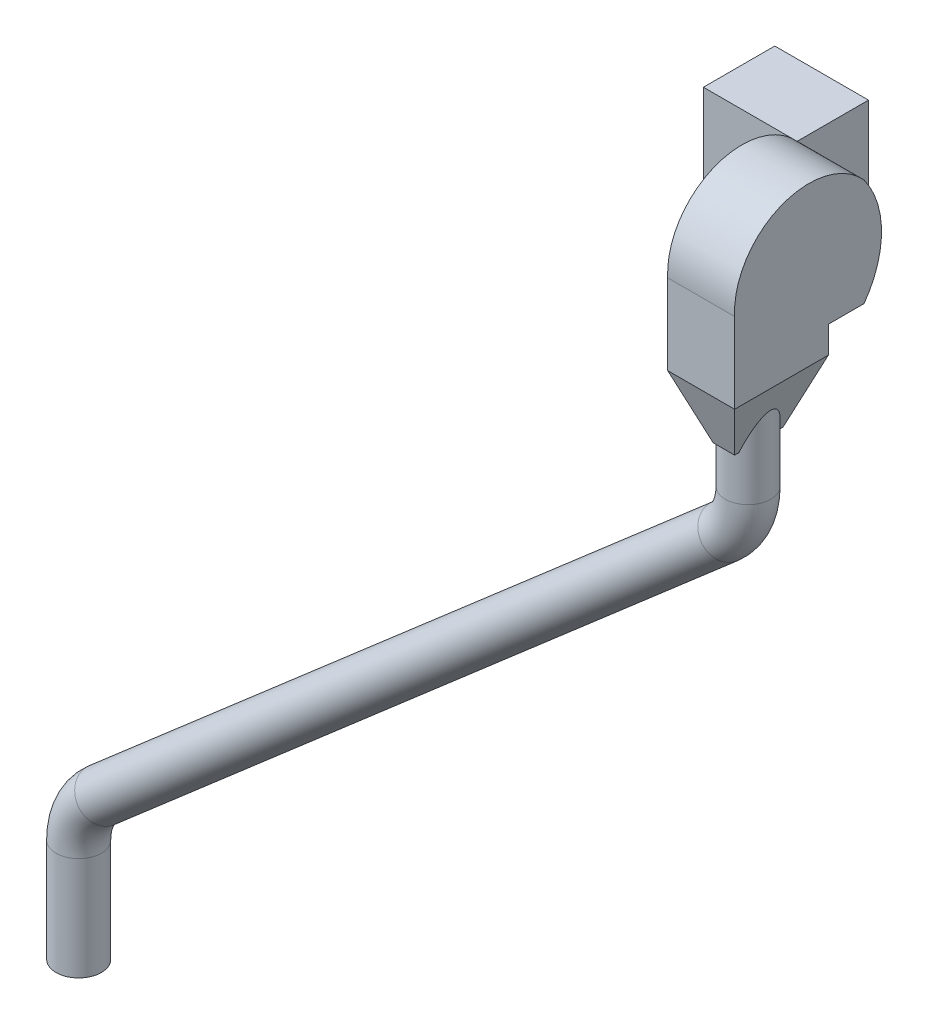
ISO-10303-21;
HEADER;
FILE_DESCRIPTION(('STEP AP214'),'2;1');
FILE_NAME('part.step','',(''),(''),'','','');
FILE_SCHEMA(('AUTOMOTIVE_DESIGN { 1 0 10303 214 1 1 1 1 }'));
ENDSEC;
DATA;
#1=APPLICATION_CONTEXT('core data for automotive mechanical design processes');
#2=APPLICATION_PROTOCOL_DEFINITION('international standard','automotive_design',2000,#1);
#3=PRODUCT_CONTEXT('',#1,'mechanical');
#4=PRODUCT('Part','Part','',(#3));
#5=PRODUCT_RELATED_PRODUCT_CATEGORY('part','',(#4));
#6=PRODUCT_DEFINITION_FORMATION('','',#4);
#7=PRODUCT_DEFINITION_CONTEXT('part definition',#1,'design');
#8=PRODUCT_DEFINITION('design','',#6,#7);
#9=PRODUCT_DEFINITION_SHAPE('','',#8);
#10=(LENGTH_UNIT() NAMED_UNIT(*) SI_UNIT(.MILLI.,.METRE.));
#11=(NAMED_UNIT(*) PLANE_ANGLE_UNIT() SI_UNIT($,.RADIAN.));
#12=(NAMED_UNIT(*) SI_UNIT($,.STERADIAN.) SOLID_ANGLE_UNIT());
#13=UNCERTAINTY_MEASURE_WITH_UNIT(LENGTH_MEASURE(1.E-05),#10,'distance_accuracy_value','');
#14=(GEOMETRIC_REPRESENTATION_CONTEXT(3) GLOBAL_UNCERTAINTY_ASSIGNED_CONTEXT((#13)) GLOBAL_UNIT_ASSIGNED_CONTEXT((#10,
#11,#12)) REPRESENTATION_CONTEXT('',''));
#15=CARTESIAN_POINT('',(0.,0.,0.));
#16=DIRECTION('',(0.,0.,1.));
#17=DIRECTION('',(1.,0.,0.));
#18=AXIS2_PLACEMENT_3D('',#15,#16,#17);
#19=CARTESIAN_POINT('',(255.,-120.,160.));
#20=DIRECTION('',(0.,1.,0.));
#21=DIRECTION('',(0.,0.,1.));
#22=AXIS2_PLACEMENT_3D('',#19,#20,#21);
#23=PLANE('',#22);
#24=DIRECTION('',(1.,0.,0.));
#25=VECTOR('',#24,1.);
#26=CARTESIAN_POINT('',(255.,-120.,239.857858587835));
#27=LINE('',#26,#25);
#28=CARTESIAN_POINT('',(105.,-120.,239.857858587835));
#29=VERTEX_POINT('',#28);
#30=CARTESIAN_POINT('',(255.,-120.,239.857858587835));
#31=VERTEX_POINT('',#30);
#32=EDGE_CURVE('E133',#29,#31,#27,.T.);
#33=ORIENTED_EDGE('',*,*,#32,.F.);
#34=DIRECTION('',(0.,0.,-1.));
#35=VECTOR('',#34,1.);
#36=CARTESIAN_POINT('',(105.,-120.,160.));
#37=LINE('',#36,#35);
#38=CARTESIAN_POINT('',(105.,-120.,160.));
#39=VERTEX_POINT('',#38);
#40=EDGE_CURVE('E145',#29,#39,#37,.T.);
#41=ORIENTED_EDGE('',*,*,#40,.T.);
#42=DIRECTION('',(-1.,0.,0.));
#43=VECTOR('',#42,1.);
#44=CARTESIAN_POINT('',(255.,-120.,160.));
#45=LINE('',#44,#43);
#46=CARTESIAN_POINT('',(255.,-120.,160.));
#47=VERTEX_POINT('',#46);
#48=EDGE_CURVE('E201',#47,#39,#45,.T.);
#49=ORIENTED_EDGE('',*,*,#48,.F.);
#50=DIRECTION('',(0.,0.,-1.));
#51=VECTOR('',#50,1.);
#52=CARTESIAN_POINT('',(255.,-120.,160.));
#53=LINE('',#52,#51);
#54=EDGE_CURVE('E199',#31,#47,#53,.T.);
#55=ORIENTED_EDGE('',*,*,#54,.F.);
#56=EDGE_LOOP('',(#33,#41,#49,#55));
#57=FACE_BOUND('',#56,.T.);
#58=ADVANCED_FACE('F45',(#57),#23,.F.);
#59=CARTESIAN_POINT('',(255.,0.,324.123215286529));
#60=DIRECTION('',(-1.,0.,0.));
#61=DIRECTION('',(0.,0.,1.));
#62=AXIS2_PLACEMENT_3D('',#59,#60,#61);
#63=CYLINDRICAL_SURFACE('',#62,203.31362422619);
#64=CARTESIAN_POINT('',(105.,0.,324.123215286529));
#65=DIRECTION('',(1.,0.,0.));
#66=DIRECTION('',(0.,0.,-1.));
#67=AXIS2_PLACEMENT_3D('',#64,#65,#66);
#68=CIRCLE('',#67,203.31362422619);
#69=CARTESIAN_POINT('',(105.,120.,160.));
#70=VERTEX_POINT('',#69);
#71=EDGE_CURVE('E191',#39,#70,#68,.T.);
#72=ORIENTED_EDGE('',*,*,#71,.T.);
#73=DIRECTION('',(-1.,0.,0.));
#74=VECTOR('',#73,1.);
#75=CARTESIAN_POINT('',(255.,120.,160.));
#76=LINE('',#75,#74);
#77=CARTESIAN_POINT('',(255.,120.,160.));
#78=VERTEX_POINT('',#77);
#79=EDGE_CURVE('E209',#78,#70,#76,.T.);
#80=ORIENTED_EDGE('',*,*,#79,.F.);
#81=CARTESIAN_POINT('',(255.,0.,324.123215286529));
#82=DIRECTION('',(1.,0.,0.));
#83=DIRECTION('',(0.,0.,-1.));
#84=AXIS2_PLACEMENT_3D('',#81,#82,#83);
#85=CIRCLE('',#84,203.31362422619);
#86=EDGE_CURVE('E192',#47,#78,#85,.T.);
#87=ORIENTED_EDGE('',*,*,#86,.F.);
#88=ORIENTED_EDGE('',*,*,#48,.T.);
#89=EDGE_LOOP('',(#72,#80,#87,#88));
#90=FACE_BOUND('',#89,.T.);
#91=ADVANCED_FACE('F47',(#90),#63,.T.);
#92=CARTESIAN_POINT('',(255.,8.53871556863522,283.705675407711));
#93=DIRECTION('',(-1.,0.,0.));
#94=DIRECTION('',(0.,0.,1.));
#95=AXIS2_PLACEMENT_3D('',#92,#93,#94);
#96=CYLINDRICAL_SURFACE('',#95,166.513399025927);
#97=CARTESIAN_POINT('',(105.,8.53871556863522,283.705675407711));
#98=DIRECTION('',(1.,0.,0.));
#99=DIRECTION('',(0.,0.,1.));
#100=AXIS2_PLACEMENT_3D('',#97,#98,#99);
#101=CIRCLE('',#100,166.513399025927);
#102=CARTESIAN_POINT('',(105.,0.,450.));
#103=VERTEX_POINT('',#102);
#104=EDGE_CURVE('E146',#70,#103,#101,.T.);
#105=ORIENTED_EDGE('',*,*,#104,.T.);
#106=DIRECTION('',(-1.,0.,0.));
#107=VECTOR('',#106,1.);
#108=CARTESIAN_POINT('',(255.,0.,450.));
#109=LINE('',#108,#107);
#110=CARTESIAN_POINT('',(255.,0.,450.));
#111=VERTEX_POINT('',#110);
#112=EDGE_CURVE('E144',#111,#103,#109,.T.);
#113=ORIENTED_EDGE('',*,*,#112,.F.);
#114=CARTESIAN_POINT('',(255.,8.53871556863522,283.705675407711));
#115=DIRECTION('',(1.,0.,0.));
#116=DIRECTION('',(0.,0.,1.));
#117=AXIS2_PLACEMENT_3D('',#114,#115,#116);
#118=CIRCLE('',#117,166.513399025927);
#119=EDGE_CURVE('E195',#78,#111,#118,.T.);
#120=ORIENTED_EDGE('',*,*,#119,.F.);
#121=ORIENTED_EDGE('',*,*,#79,.T.);
#122=EDGE_LOOP('',(#105,#113,#120,#121));
#123=FACE_BOUND('',#122,.T.);
#124=ADVANCED_FACE('F234',(#123),#96,.T.);
#125=CARTESIAN_POINT('',(255.,-120.,450.));
#126=DIRECTION('',(0.,0.,-1.));
#127=DIRECTION('',(-1.,0.,0.));
#128=AXIS2_PLACEMENT_3D('',#125,#126,#127);
#129=PLANE('',#128);
#130=DIRECTION('',(0.,-1.,0.));
#131=VECTOR('',#130,1.);
#132=CARTESIAN_POINT('',(105.,-120.,450.));
#133=LINE('',#132,#131);
#134=CARTESIAN_POINT('',(105.,-180.,450.));
#135=VERTEX_POINT('',#134);
#136=EDGE_CURVE('E124',#103,#135,#133,.T.);
#137=ORIENTED_EDGE('',*,*,#136,.T.);
#138=DIRECTION('',(-1.,0.,0.));
#139=VECTOR('',#138,1.);
#140=CARTESIAN_POINT('',(105.,-180.,450.));
#141=LINE('',#140,#139);
#142=CARTESIAN_POINT('',(255.,-180.,450.));
#143=VERTEX_POINT('',#142);
#144=EDGE_CURVE('E141',#143,#135,#141,.T.);
#145=ORIENTED_EDGE('',*,*,#144,.F.);
#146=DIRECTION('',(0.,-1.,0.));
#147=VECTOR('',#146,1.);
#148=CARTESIAN_POINT('',(255.,-120.,450.));
#149=LINE('',#148,#147);
#150=EDGE_CURVE('E197',#111,#143,#149,.T.);
#151=ORIENTED_EDGE('',*,*,#150,.F.);
#152=ORIENTED_EDGE('',*,*,#112,.T.);
#153=EDGE_LOOP('',(#137,#145,#151,#152));
#154=FACE_BOUND('',#153,.T.);
#155=ADVANCED_FACE('F139',(#154),#129,.F.);
#156=CARTESIAN_POINT('',(255.,0.,324.123215286529));
#157=DIRECTION('',(1.,0.,0.));
#158=DIRECTION('',(0.,0.,-1.));
#159=AXIS2_PLACEMENT_3D('',#156,#157,#158);
#160=PLANE('',#159);
#161=ORIENTED_EDGE('',*,*,#86,.T.);
#162=ORIENTED_EDGE('',*,*,#119,.T.);
#163=ORIENTED_EDGE('',*,*,#150,.T.);
#164=DIRECTION('',(0.,0.,1.));
#165=VECTOR('',#164,1.);
#166=CARTESIAN_POINT('',(255.,-180.,450.));
#167=LINE('',#166,#165);
#168=CARTESIAN_POINT('',(255.,-180.,239.857858587835));
#169=VERTEX_POINT('',#168);
#170=EDGE_CURVE('E158',#169,#143,#167,.T.);
#171=ORIENTED_EDGE('',*,*,#170,.F.);
#172=DIRECTION('',(0.,1.,0.));
#173=VECTOR('',#172,1.);
#174=CARTESIAN_POINT('',(255.,-180.,239.857858587835));
#175=LINE('',#174,#173);
#176=EDGE_CURVE('E157',#169,#31,#175,.T.);
#177=ORIENTED_EDGE('',*,*,#176,.T.);
#178=ORIENTED_EDGE('',*,*,#54,.T.);
#179=EDGE_LOOP('',(#161,#162,#163,#171,#177,#178));
#180=FACE_BOUND('',#179,.T.);
#181=ADVANCED_FACE('F222',(#180),#160,.T.);
#182=CARTESIAN_POINT('',(105.,0.,324.123215286529));
#183=DIRECTION('',(1.,0.,0.));
#184=DIRECTION('',(0.,0.,-1.));
#185=AXIS2_PLACEMENT_3D('',#182,#183,#184);
#186=PLANE('',#185);
#187=ORIENTED_EDGE('',*,*,#71,.F.);
#188=ORIENTED_EDGE('',*,*,#40,.F.);
#189=DIRECTION('',(0.,1.,0.));
#190=VECTOR('',#189,1.);
#191=CARTESIAN_POINT('',(105.,-180.,239.857858587835));
#192=LINE('',#191,#190);
#193=CARTESIAN_POINT('',(105.,-180.,239.857858587835));
#194=VERTEX_POINT('',#193);
#195=EDGE_CURVE('E127',#194,#29,#192,.T.);
#196=ORIENTED_EDGE('',*,*,#195,.F.);
#197=DIRECTION('',(0.,0.,-1.));
#198=VECTOR('',#197,1.);
#199=CARTESIAN_POINT('',(105.,-180.,239.857858587835));
#200=LINE('',#199,#198);
#201=EDGE_CURVE('E120',#135,#194,#200,.T.);
#202=ORIENTED_EDGE('',*,*,#201,.F.);
#203=ORIENTED_EDGE('',*,*,#136,.F.);
#204=ORIENTED_EDGE('',*,*,#104,.F.);
#205=EDGE_LOOP('',(#187,#188,#196,#202,#203,#204));
#206=FACE_BOUND('',#205,.T.);
#207=ADVANCED_FACE('F123',(#206),#186,.F.);
#208=CARTESIAN_POINT('',(255.,-180.,239.857858587835));
#209=DIRECTION('',(0.,0.,1.));
#210=DIRECTION('',(0.,-1.,0.));
#211=AXIS2_PLACEMENT_3D('',#208,#209,#210);
#212=PLANE('',#211);
#213=ORIENTED_EDGE('',*,*,#32,.T.);
#214=ORIENTED_EDGE('',*,*,#176,.F.);
#215=DIRECTION('',(1.,0.,0.));
#216=VECTOR('',#215,1.);
#217=CARTESIAN_POINT('',(255.,-180.,239.857858587835));
#218=LINE('',#217,#216);
#219=EDGE_CURVE('E132',#194,#169,#218,.T.);
#220=ORIENTED_EDGE('',*,*,#219,.F.);
#221=ORIENTED_EDGE('',*,*,#195,.T.);
#222=EDGE_LOOP('',(#213,#214,#220,#221));
#223=FACE_BOUND('',#222,.T.);
#224=ADVANCED_FACE('F227',(#223),#212,.F.);
#225=CARTESIAN_POINT('',(0.,-320.,0.));
#226=DIRECTION('',(0.,1.,0.));
#227=DIRECTION('',(0.,0.,1.));
#228=AXIS2_PLACEMENT_3D('',#225,#226,#227);
#229=PLANE('',#228);
#230=DIRECTION('',(0.,0.,-1.));
#231=VECTOR('',#230,1.);
#232=CARTESIAN_POINT('',(204.044167202732,-320.,0.));
#233=LINE('',#232,#231);
#234=CARTESIAN_POINT('',(204.044167202732,-320.,290.813691385104));
#235=VERTEX_POINT('',#234);
#236=CARTESIAN_POINT('',(204.044167202732,-320.,300.179426240508));
#237=VERTEX_POINT('',#236);
#238=EDGE_CURVE('E168',#235,#237,#233,.F.);
#239=ORIENTED_EDGE('',*,*,#238,.T.);
#240=CARTESIAN_POINT('',(180.,-320.,344.928929293918));
#241=DIRECTION('',(0.,1.,0.));
#242=DIRECTION('',(0.,0.,1.));
#243=AXIS2_PLACEMENT_3D('',#240,#241,#242);
#244=CIRCLE('',#243,50.8);
#245=CARTESIAN_POINT('',(155.955832797268,-320.,300.179426240508));
#246=VERTEX_POINT('',#245);
#247=EDGE_CURVE('E12',#237,#246,#244,.T.);
#248=ORIENTED_EDGE('',*,*,#247,.T.);
#249=DIRECTION('',(0.,0.,1.));
#250=VECTOR('',#249,1.);
#251=CARTESIAN_POINT('',(155.955832797268,-320.,0.));
#252=LINE('',#251,#250);
#253=CARTESIAN_POINT('',(155.955832797268,-320.,290.813691385104));
#254=VERTEX_POINT('',#253);
#255=EDGE_CURVE('E178',#246,#254,#252,.F.);
#256=ORIENTED_EDGE('',*,*,#255,.T.);
#257=DIRECTION('',(-1.,0.,0.));
#258=VECTOR('',#257,1.);
#259=CARTESIAN_POINT('',(0.,-320.,290.813691385104));
#260=LINE('',#259,#258);
#261=EDGE_CURVE('E177',#254,#235,#260,.F.);
#262=ORIENTED_EDGE('',*,*,#261,.T.);
#263=EDGE_LOOP('',(#239,#248,#256,#262));
#264=FACE_BOUND('',#263,.T.);
#265=ADVANCED_FACE('F252',(#264),#229,.F.);
#266=CARTESIAN_POINT('',(105.,-180.,239.857858587835));
#267=DIRECTION('',(-0.939692620785908,-0.342020143325669,0.));
#268=DIRECTION('',(0.342020143325669,-0.939692620785908,0.));
#269=AXIS2_PLACEMENT_3D('',#266,#267,#268);
#270=PLANE('',#269);
#271=ORIENTED_EDGE('',*,*,#255,.F.);
#272=CARTESIAN_POINT('',(180.,-386.060806459097,344.928929293918));
#273=DIRECTION('',(-0.939692620785908,-0.342020143325669,0.));
#274=DIRECTION('',(-0.342020143325669,0.939692620785908,0.));
#275=AXIS2_PLACEMENT_3D('',#272,#273,#274);
#276=ELLIPSE('',#275,148.529263528285,50.8);
#277=CARTESIAN_POINT('',(155.955832797268,-320.,389.678432347327));
#278=VERTEX_POINT('',#277);
#279=EDGE_CURVE('E49',#246,#278,#276,.F.);
#280=ORIENTED_EDGE('',*,*,#279,.T.);
#281=CARTESIAN_POINT('',(155.955832797268,-320.,399.044167202732));
#282=VERTEX_POINT('',#281);
#283=EDGE_CURVE('E163',#282,#278,#252,.F.);
#284=ORIENTED_EDGE('',*,*,#283,.F.);
#285=DIRECTION('',(-0.323615577118185,0.889126490715988,0.323615577118185));
#286=VECTOR('',#285,1.);
#287=CARTESIAN_POINT('',(127.007564817849,-240.465287394225,427.992435182151));
#288=LINE('',#287,#286);
#289=EDGE_CURVE('E153',#282,#135,#288,.T.);
#290=ORIENTED_EDGE('',*,*,#289,.T.);
#291=ORIENTED_EDGE('',*,*,#201,.T.);
#292=DIRECTION('',(-0.323615577118185,0.889126490715988,-0.323615577118185));
#293=VECTOR('',#292,1.);
#294=CARTESIAN_POINT('',(120.70905626303,-223.160277363618,255.566914850866));
#295=LINE('',#294,#293);
#296=EDGE_CURVE('E171',#254,#194,#295,.T.);
#297=ORIENTED_EDGE('',*,*,#296,.F.);
#298=EDGE_LOOP('',(#271,#280,#284,#290,#291,#297));
#299=FACE_BOUND('',#298,.T.);
#300=ADVANCED_FACE('F161',(#299),#270,.T.);
#301=CARTESIAN_POINT('',(255.,-180.,239.857858587835));
#302=DIRECTION('',(0.,-0.342020143325669,-0.939692620785908));
#303=DIRECTION('',(0.,0.939692620785908,-0.342020143325669));
#304=AXIS2_PLACEMENT_3D('',#301,#302,#303);
#305=PLANE('',#304);
#306=ORIENTED_EDGE('',*,*,#219,.T.);
#307=DIRECTION('',(0.323615577118185,0.889126490715988,-0.323615577118185));
#308=VECTOR('',#307,1.);
#309=CARTESIAN_POINT('',(232.992435182151,-240.465287394225,261.865423405684));
#310=LINE('',#309,#308);
#311=EDGE_CURVE('E166',#235,#169,#310,.T.);
#312=ORIENTED_EDGE('',*,*,#311,.F.);
#313=ORIENTED_EDGE('',*,*,#261,.F.);
#314=ORIENTED_EDGE('',*,*,#296,.T.);
#315=EDGE_LOOP('',(#306,#312,#313,#314));
#316=FACE_BOUND('',#315,.T.);
#317=ADVANCED_FACE('F224',(#316),#305,.T.);
#318=CARTESIAN_POINT('',(255.,-180.,450.));
#319=DIRECTION('',(0.939692620785908,-0.342020143325669,0.));
#320=DIRECTION('',(0.342020143325669,0.939692620785908,0.));
#321=AXIS2_PLACEMENT_3D('',#318,#319,#320);
#322=PLANE('',#321);
#323=CARTESIAN_POINT('',(204.044167202732,-320.,389.678432347327));
#324=VERTEX_POINT('',#323);
#325=CARTESIAN_POINT('',(204.044167202732,-320.,399.044167202732));
#326=VERTEX_POINT('',#325);
#327=EDGE_CURVE('E180',#324,#326,#233,.F.);
#328=ORIENTED_EDGE('',*,*,#327,.F.);
#329=CARTESIAN_POINT('',(180.,-386.060806459097,344.928929293918));
#330=DIRECTION('',(0.939692620785908,-0.342020143325669,0.));
#331=DIRECTION('',(0.342020143325669,0.939692620785908,0.));
#332=AXIS2_PLACEMENT_3D('',#329,#330,#331);
#333=ELLIPSE('',#332,148.529263528285,50.8);
#334=EDGE_CURVE('E212',#324,#237,#333,.F.);
#335=ORIENTED_EDGE('',*,*,#334,.T.);
#336=ORIENTED_EDGE('',*,*,#238,.F.);
#337=ORIENTED_EDGE('',*,*,#311,.T.);
#338=ORIENTED_EDGE('',*,*,#170,.T.);
#339=DIRECTION('',(0.323615577118185,0.889126490715988,0.323615577118185));
#340=VECTOR('',#339,1.);
#341=CARTESIAN_POINT('',(239.29094373697,-223.160277363618,434.29094373697));
#342=LINE('',#341,#340);
#343=EDGE_CURVE('E156',#326,#143,#342,.T.);
#344=ORIENTED_EDGE('',*,*,#343,.F.);
#345=EDGE_LOOP('',(#328,#335,#336,#337,#338,#344));
#346=FACE_BOUND('',#345,.T.);
#347=ADVANCED_FACE('F218',(#346),#322,.T.);
#348=CARTESIAN_POINT('',(105.,-180.,450.));
#349=DIRECTION('',(0.,-0.342020143325669,0.939692620785908));
#350=DIRECTION('',(0.,-0.939692620785908,-0.342020143325669));
#351=AXIS2_PLACEMENT_3D('',#348,#349,#350);
#352=PLANE('',#351);
#353=ORIENTED_EDGE('',*,*,#144,.T.);
#354=ORIENTED_EDGE('',*,*,#289,.F.);
#355=DIRECTION('',(1.,0.,0.));
#356=VECTOR('',#355,1.);
#357=CARTESIAN_POINT('',(0.,-320.,399.044167202732));
#358=LINE('',#357,#356);
#359=EDGE_CURVE('E164',#326,#282,#358,.F.);
#360=ORIENTED_EDGE('',*,*,#359,.F.);
#361=ORIENTED_EDGE('',*,*,#343,.T.);
#362=EDGE_LOOP('',(#353,#354,#360,#361));
#363=FACE_BOUND('',#362,.T.);
#364=ADVANCED_FACE('F151',(#363),#352,.T.);
#365=ORIENTED_EDGE('',*,*,#283,.T.);
#366=EDGE_CURVE('E55',#278,#324,#244,.T.);
#367=ORIENTED_EDGE('',*,*,#366,.T.);
#368=ORIENTED_EDGE('',*,*,#327,.T.);
#369=ORIENTED_EDGE('',*,*,#359,.T.);
#370=EDGE_LOOP('',(#365,#367,#368,#369));
#371=FACE_BOUND('',#370,.T.);
#372=ADVANCED_FACE('F217',(#371),#229,.F.);
#373=CARTESIAN_POINT('',(180.,-350.,344.928929293918));
#374=DIRECTION('',(0.,1.,0.));
#375=DIRECTION('',(0.,0.,1.));
#376=AXIS2_PLACEMENT_3D('',#373,#374,#375);
#377=CYLINDRICAL_SURFACE('',#376,50.8);
#378=ORIENTED_EDGE('',*,*,#247,.F.);
#379=ORIENTED_EDGE('',*,*,#334,.F.);
#380=ORIENTED_EDGE('',*,*,#366,.F.);
#381=ORIENTED_EDGE('',*,*,#279,.F.);
#382=EDGE_LOOP('',(#378,#379,#380,#381));
#383=FACE_BOUND('',#382,.T.);
#384=CARTESIAN_POINT('',(180.,-419.373633231244,344.928929293918));
#385=DIRECTION('',(0.,-1.,0.));
#386=DIRECTION('',(0.,0.,-1.));
#387=AXIS2_PLACEMENT_3D('',#384,#385,#386);
#388=CIRCLE('',#387,50.8);
#389=CARTESIAN_POINT('',(230.8,-419.373633231244,344.928929293918));
#390=VERTEX_POINT('',#389);
#391=EDGE_CURVE('E291',#390,#390,#388,.T.);
#392=ORIENTED_EDGE('',*,*,#391,.F.);
#393=EDGE_LOOP('',(#392));
#394=FACE_BOUND('',#393,.T.);
#395=ADVANCED_FACE('F253',(#383,#394),#377,.T.);
#396=CARTESIAN_POINT('',(30.,-419.373633231244,344.928929293918));
#397=DIRECTION('',(0.,0.,-1.));
#398=DIRECTION('',(-1.,0.,0.));
#399=AXIS2_PLACEMENT_3D('',#396,#397,#398);
#400=TOROIDAL_SURFACE('',#399,150.,50.8);
#401=CARTESIAN_POINT('',(128.239580762676,-532.726995649717,344.928929293918));
#402=DIRECTION('',(-0.755689082789818,-0.654930538417841,0.));
#403=DIRECTION('',(0.,0.,-1.));
#404=AXIS2_PLACEMENT_3D('',#401,#402,#403);
#405=CIRCLE('',#404,50.8);
#406=CARTESIAN_POINT('',(161.510052114303,-571.11600105544,344.928929293918));
#407=VERTEX_POINT('',#406);
#408=EDGE_CURVE('E294',#407,#407,#405,.T.);
#409=CARTESIAN_POINT('',(30.,-419.373633231244,344.928929293918));
#410=DIRECTION('',(0.,0.,-1.));
#411=DIRECTION('',(-1.,0.,0.));
#412=AXIS2_PLACEMENT_3D('',#409,#410,#411);
#413=CIRCLE('',#412,200.8);
#414=EDGE_CURVE('',#390,#407,#413,.T.);
#415=ORIENTED_EDGE('',*,*,#391,.T.);
#416=ORIENTED_EDGE('',*,*,#408,.F.);
#417=ORIENTED_EDGE('',*,*,#414,.T.);
#418=ORIENTED_EDGE('',*,*,#414,.F.);
#419=EDGE_LOOP('',(#415,#417,#416,#418));
#420=FACE_BOUND('',#419,.T.);
#421=ADVANCED_FACE('F256',(#420),#400,.T.);
#422=CARTESIAN_POINT('',(128.239580762676,-532.726995649717,344.928929293918));
#423=DIRECTION('',(-0.755689082789818,-0.654930538417842,0.));
#424=DIRECTION('',(0.654930538417842,-0.755689082789818,0.));
#425=AXIS2_PLACEMENT_3D('',#422,#423,#424);
#426=CYLINDRICAL_SURFACE('',#425,50.8);
#427=CARTESIAN_POINT('',(-1268.23958076268,-1743.00893563836,344.928929293918));
#428=DIRECTION('',(-0.755689082789818,-0.654930538417841,0.));
#429=DIRECTION('',(0.,0.,-1.));
#430=AXIS2_PLACEMENT_3D('',#427,#428,#429);
#431=CIRCLE('',#430,50.8);
#432=CARTESIAN_POINT('',(-1301.5100521143,-1704.61993023263,344.928929293918));
#433=VERTEX_POINT('',#432);
#434=EDGE_CURVE('E299',#433,#433,#431,.T.);
#435=ORIENTED_EDGE('',*,*,#434,.F.);
#436=EDGE_LOOP('',(#435));
#437=FACE_BOUND('',#436,.T.);
#438=ORIENTED_EDGE('',*,*,#408,.T.);
#439=EDGE_LOOP('',(#438));
#440=FACE_BOUND('',#439,.T.);
#441=ADVANCED_FACE('F275',(#437,#440),#426,.T.);
#442=CARTESIAN_POINT('',(-1170.,-1856.36229805683,344.928929293918));
#443=DIRECTION('',(0.,0.,1.));
#444=DIRECTION('',(1.,0.,0.));
#445=AXIS2_PLACEMENT_3D('',#442,#443,#444);
#446=TOROIDAL_SURFACE('',#445,150.,50.8);
#447=CARTESIAN_POINT('',(-1320.,-1856.36229805683,344.928929293918));
#448=DIRECTION('',(0.,-1.,0.));
#449=DIRECTION('',(0.,0.,-1.));
#450=AXIS2_PLACEMENT_3D('',#447,#448,#449);
#451=CIRCLE('',#450,50.8);
#452=CARTESIAN_POINT('',(-1370.8,-1856.36229805683,344.928929293918));
#453=VERTEX_POINT('',#452);
#454=EDGE_CURVE('E301',#453,#453,#451,.T.);
#455=CARTESIAN_POINT('',(-1170.,-1856.36229805683,344.928929293918));
#456=DIRECTION('',(0.,0.,1.));
#457=DIRECTION('',(1.,0.,0.));
#458=AXIS2_PLACEMENT_3D('',#455,#456,#457);
#459=CIRCLE('',#458,200.8);
#460=EDGE_CURVE('',#433,#453,#459,.T.);
#461=ORIENTED_EDGE('',*,*,#434,.T.);
#462=ORIENTED_EDGE('',*,*,#454,.F.);
#463=ORIENTED_EDGE('',*,*,#460,.T.);
#464=ORIENTED_EDGE('',*,*,#460,.F.);
#465=EDGE_LOOP('',(#461,#463,#462,#464));
#466=FACE_BOUND('',#465,.T.);
#467=ADVANCED_FACE('F271',(#466),#446,.T.);
#468=CARTESIAN_POINT('',(-1320.,-1856.36229805683,344.928929293918));
#469=DIRECTION('',(0.,-1.,0.));
#470=DIRECTION('',(0.,0.,-1.));
#471=AXIS2_PLACEMENT_3D('',#468,#469,#470);
#472=CYLINDRICAL_SURFACE('',#471,50.8);
#473=ORIENTED_EDGE('',*,*,#454,.T.);
#474=EDGE_LOOP('',(#473));
#475=FACE_BOUND('',#474,.T.);
#476=CARTESIAN_POINT('',(-1320.,-2087.86796564404,344.928929293918));
#477=DIRECTION('',(0.,-1.,0.));
#478=DIRECTION('',(0.,0.,-1.));
#479=AXIS2_PLACEMENT_3D('',#476,#477,#478);
#480=CIRCLE('',#479,50.8);
#481=CARTESIAN_POINT('',(-1320.,-2087.86796564404,294.128929293918));
#482=VERTEX_POINT('',#481);
#483=EDGE_CURVE('E289',#482,#482,#480,.T.);
#484=ORIENTED_EDGE('',*,*,#483,.F.);
#485=EDGE_LOOP('',(#484));
#486=FACE_BOUND('',#485,.T.);
#487=ADVANCED_FACE('F257',(#475,#486),#472,.T.);
#488=CARTESIAN_POINT('',(-1320.,-2087.86796564404,344.928929293918));
#489=DIRECTION('',(0.,-1.,0.));
#490=DIRECTION('',(0.,0.,-1.));
#491=AXIS2_PLACEMENT_3D('',#488,#489,#490);
#492=PLANE('',#491);
#493=ORIENTED_EDGE('',*,*,#483,.T.);
#494=EDGE_LOOP('',(#493));
#495=FACE_BOUND('',#494,.T.);
#496=ADVANCED_FACE('F270',(#495),#492,.T.);
#497=CLOSED_SHELL('',(#58,#91,#124,#155,#181,#207,#224,#265,#300,#317,#347,#364,#372,#395,#421,
#441,#467,#487,#496));
#498=MANIFOLD_SOLID_BREP('B2',#497);
#499=CARTESIAN_POINT('',(105.,-120.,160.));
#500=DIRECTION('',(-1.,0.,0.));
#501=DIRECTION('',(0.,0.,1.));
#502=AXIS2_PLACEMENT_3D('',#499,#500,#501);
#503=PLANE('',#502);
#504=DIRECTION('',(0.,1.,0.));
#505=VECTOR('',#504,1.);
#506=CARTESIAN_POINT('',(105.,-120.,0.));
#507=LINE('',#506,#505);
#508=CARTESIAN_POINT('',(105.,-120.,0.));
#509=VERTEX_POINT('',#508);
#510=CARTESIAN_POINT('',(105.,120.,0.));
#511=VERTEX_POINT('',#510);
#512=EDGE_CURVE('E527',#509,#511,#507,.T.);
#513=ORIENTED_EDGE('',*,*,#512,.T.);
#514=DIRECTION('',(0.,0.,-1.));
#515=VECTOR('',#514,1.);
#516=CARTESIAN_POINT('',(105.,120.,160.));
#517=LINE('',#516,#515);
#518=CARTESIAN_POINT('',(105.,120.,160.));
#519=VERTEX_POINT('',#518);
#520=EDGE_CURVE('E43',#519,#511,#517,.T.);
#521=ORIENTED_EDGE('',*,*,#520,.F.);
#522=DIRECTION('',(0.,1.,0.));
#523=VECTOR('',#522,1.);
#524=CARTESIAN_POINT('',(105.,-120.,160.));
#525=LINE('',#524,#523);
#526=CARTESIAN_POINT('',(105.,-120.,160.));
#527=VERTEX_POINT('',#526);
#528=EDGE_CURVE('E515',#527,#519,#525,.T.);
#529=ORIENTED_EDGE('',*,*,#528,.F.);
#530=DIRECTION('',(0.,0.,-1.));
#531=VECTOR('',#530,1.);
#532=CARTESIAN_POINT('',(105.,-120.,160.));
#533=LINE('',#532,#531);
#534=EDGE_CURVE('E523',#527,#509,#533,.T.);
#535=ORIENTED_EDGE('',*,*,#534,.T.);
#536=EDGE_LOOP('',(#513,#521,#529,#535));
#537=FACE_BOUND('',#536,.T.);
#538=ADVANCED_FACE('F464',(#537),#503,.F.);
#539=CARTESIAN_POINT('',(-105.,120.,160.));
#540=DIRECTION('',(0.,-1.,0.));
#541=DIRECTION('',(0.,0.,-1.));
#542=AXIS2_PLACEMENT_3D('',#539,#540,#541);
#543=PLANE('',#542);
#544=DIRECTION('',(-1.,0.,0.));
#545=VECTOR('',#544,1.);
#546=CARTESIAN_POINT('',(-105.,120.,0.));
#547=LINE('',#546,#545);
#548=CARTESIAN_POINT('',(-105.,120.,0.));
#549=VERTEX_POINT('',#548);
#550=EDGE_CURVE('E519',#511,#549,#547,.T.);
#551=ORIENTED_EDGE('',*,*,#550,.T.);
#552=DIRECTION('',(0.,0.,-1.));
#553=VECTOR('',#552,1.);
#554=CARTESIAN_POINT('',(-105.,120.,160.));
#555=LINE('',#554,#553);
#556=CARTESIAN_POINT('',(-105.,120.,160.));
#557=VERTEX_POINT('',#556);
#558=EDGE_CURVE('E472',#557,#549,#555,.T.);
#559=ORIENTED_EDGE('',*,*,#558,.F.);
#560=DIRECTION('',(-1.,0.,0.));
#561=VECTOR('',#560,1.);
#562=CARTESIAN_POINT('',(-105.,120.,160.));
#563=LINE('',#562,#561);
#564=EDGE_CURVE('E510',#519,#557,#563,.T.);
#565=ORIENTED_EDGE('',*,*,#564,.F.);
#566=ORIENTED_EDGE('',*,*,#520,.T.);
#567=EDGE_LOOP('',(#551,#559,#565,#566));
#568=FACE_BOUND('',#567,.T.);
#569=ADVANCED_FACE('F518',(#568),#543,.F.);
#570=CARTESIAN_POINT('',(-105.,-120.,160.));
#571=DIRECTION('',(1.,0.,0.));
#572=DIRECTION('',(0.,0.,-1.));
#573=AXIS2_PLACEMENT_3D('',#570,#571,#572);
#574=PLANE('',#573);
#575=DIRECTION('',(0.,-1.,0.));
#576=VECTOR('',#575,1.);
#577=CARTESIAN_POINT('',(-105.,-120.,0.));
#578=LINE('',#577,#576);
#579=CARTESIAN_POINT('',(-105.,-120.,0.));
#580=VERTEX_POINT('',#579);
#581=EDGE_CURVE('E497',#549,#580,#578,.T.);
#582=ORIENTED_EDGE('',*,*,#581,.T.);
#583=DIRECTION('',(0.,0.,-1.));
#584=VECTOR('',#583,1.);
#585=CARTESIAN_POINT('',(-105.,-120.,160.));
#586=LINE('',#585,#584);
#587=CARTESIAN_POINT('',(-105.,-120.,160.));
#588=VERTEX_POINT('',#587);
#589=EDGE_CURVE('E520',#588,#580,#586,.T.);
#590=ORIENTED_EDGE('',*,*,#589,.F.);
#591=DIRECTION('',(0.,-1.,0.));
#592=VECTOR('',#591,1.);
#593=CARTESIAN_POINT('',(-105.,-120.,160.));
#594=LINE('',#593,#592);
#595=EDGE_CURVE('E513',#557,#588,#594,.T.);
#596=ORIENTED_EDGE('',*,*,#595,.F.);
#597=ORIENTED_EDGE('',*,*,#558,.T.);
#598=EDGE_LOOP('',(#582,#590,#596,#597));
#599=FACE_BOUND('',#598,.T.);
#600=ADVANCED_FACE('F521',(#599),#574,.F.);
#601=CARTESIAN_POINT('',(-105.,-120.,160.));
#602=DIRECTION('',(0.,1.,0.));
#603=DIRECTION('',(0.,0.,1.));
#604=AXIS2_PLACEMENT_3D('',#601,#602,#603);
#605=PLANE('',#604);
#606=DIRECTION('',(1.,0.,0.));
#607=VECTOR('',#606,1.);
#608=CARTESIAN_POINT('',(-105.,-120.,0.));
#609=LINE('',#608,#607);
#610=EDGE_CURVE('E503',#580,#509,#609,.T.);
#611=ORIENTED_EDGE('',*,*,#610,.T.);
#612=ORIENTED_EDGE('',*,*,#534,.F.);
#613=DIRECTION('',(1.,0.,0.));
#614=VECTOR('',#613,1.);
#615=CARTESIAN_POINT('',(-105.,-120.,160.));
#616=LINE('',#615,#614);
#617=EDGE_CURVE('E480',#588,#527,#616,.T.);
#618=ORIENTED_EDGE('',*,*,#617,.F.);
#619=ORIENTED_EDGE('',*,*,#589,.T.);
#620=EDGE_LOOP('',(#611,#612,#618,#619));
#621=FACE_BOUND('',#620,.T.);
#622=ADVANCED_FACE('F534',(#621),#605,.F.);
#623=CARTESIAN_POINT('',(0.,0.,160.));
#624=DIRECTION('',(0.,0.,-1.));
#625=DIRECTION('',(-1.,0.,0.));
#626=AXIS2_PLACEMENT_3D('',#623,#624,#625);
#627=PLANE('',#626);
#628=ORIENTED_EDGE('',*,*,#528,.T.);
#629=ORIENTED_EDGE('',*,*,#564,.T.);
#630=ORIENTED_EDGE('',*,*,#595,.T.);
#631=ORIENTED_EDGE('',*,*,#617,.T.);
#632=EDGE_LOOP('',(#628,#629,#630,#631));
#633=FACE_BOUND('',#632,.T.);
#634=ADVANCED_FACE('F511',(#633),#627,.F.);
#635=CARTESIAN_POINT('',(0.,0.,0.));
#636=DIRECTION('',(0.,0.,-1.));
#637=DIRECTION('',(-1.,0.,0.));
#638=AXIS2_PLACEMENT_3D('',#635,#636,#637);
#639=PLANE('',#638);
#640=ORIENTED_EDGE('',*,*,#512,.F.);
#641=ORIENTED_EDGE('',*,*,#610,.F.);
#642=ORIENTED_EDGE('',*,*,#581,.F.);
#643=ORIENTED_EDGE('',*,*,#550,.F.);
#644=EDGE_LOOP('',(#640,#641,#642,#643));
#645=FACE_BOUND('',#644,.T.);
#646=ADVANCED_FACE('F537',(#645),#639,.T.);
#647=CLOSED_SHELL('',(#538,#569,#600,#622,#634,#646));
#648=MANIFOLD_SOLID_BREP('B6',#647);
#649=ADVANCED_BREP_SHAPE_REPRESENTATION('',(#18,#498,#648),#14);
#650=SHAPE_DEFINITION_REPRESENTATION(#9,#649);
ENDSEC;
END-ISO-10303-21;
